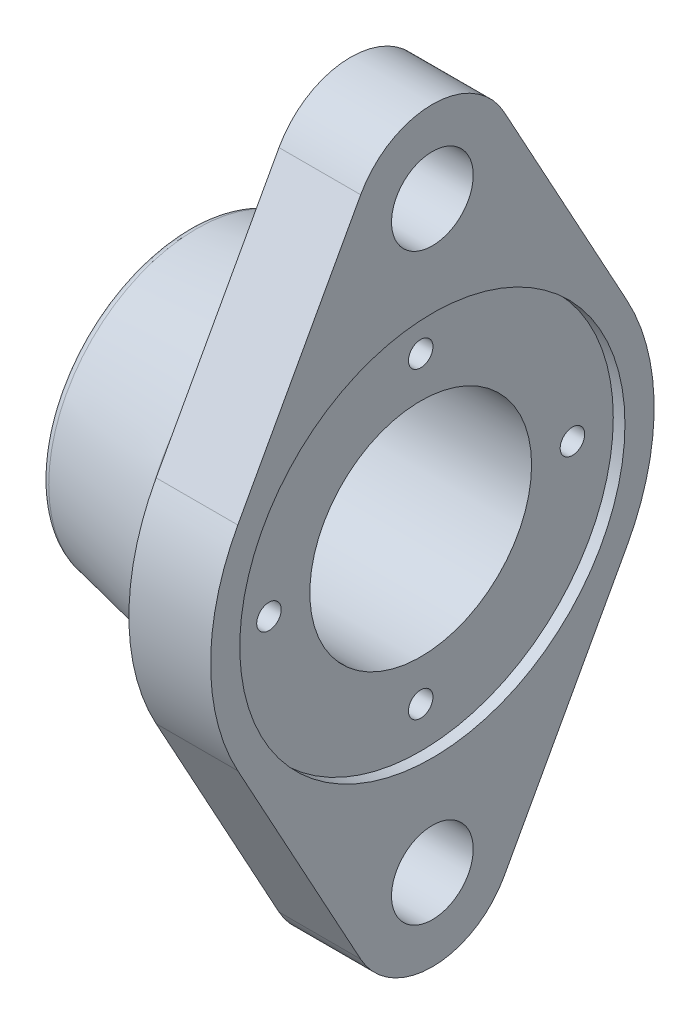
ISO-10303-21;
HEADER;
FILE_DESCRIPTION(('STEP AP214'),'2;1');
FILE_NAME('part.step','',(''),(''),'','','');
FILE_SCHEMA(('AUTOMOTIVE_DESIGN { 1 0 10303 214 1 1 1 1 }'));
ENDSEC;
DATA;
#1=APPLICATION_CONTEXT('core data for automotive mechanical design processes');
#2=APPLICATION_PROTOCOL_DEFINITION('international standard','automotive_design',2000,#1);
#3=PRODUCT_CONTEXT('',#1,'mechanical');
#4=PRODUCT('Part','Part','',(#3));
#5=PRODUCT_RELATED_PRODUCT_CATEGORY('part','',(#4));
#6=PRODUCT_DEFINITION_FORMATION('','',#4);
#7=PRODUCT_DEFINITION_CONTEXT('part definition',#1,'design');
#8=PRODUCT_DEFINITION('design','',#6,#7);
#9=PRODUCT_DEFINITION_SHAPE('','',#8);
#10=(LENGTH_UNIT() NAMED_UNIT(*) SI_UNIT(.MILLI.,.METRE.));
#11=(NAMED_UNIT(*) PLANE_ANGLE_UNIT() SI_UNIT($,.RADIAN.));
#12=(NAMED_UNIT(*) SI_UNIT($,.STERADIAN.) SOLID_ANGLE_UNIT());
#13=UNCERTAINTY_MEASURE_WITH_UNIT(LENGTH_MEASURE(1.E-05),#10,'distance_accuracy_value','');
#14=(GEOMETRIC_REPRESENTATION_CONTEXT(3) GLOBAL_UNCERTAINTY_ASSIGNED_CONTEXT((#13)) GLOBAL_UNIT_ASSIGNED_CONTEXT((#10,
#11,#12)) REPRESENTATION_CONTEXT('',''));
#15=CARTESIAN_POINT('',(0.,0.,0.));
#16=DIRECTION('',(0.,0.,1.));
#17=DIRECTION('',(1.,0.,0.));
#18=AXIS2_PLACEMENT_3D('',#15,#16,#17);
#19=CARTESIAN_POINT('',(-37.4302138620433,0.,0.));
#20=DIRECTION('',(-1.,0.,0.));
#21=DIRECTION('',(0.,0.,1.));
#22=AXIS2_PLACEMENT_3D('',#19,#20,#21);
#23=CYLINDRICAL_SURFACE('',#22,19.);
#24=CARTESIAN_POINT('',(-22.,0.,0.));
#25=DIRECTION('',(1.,0.,0.));
#26=DIRECTION('',(0.,0.,-1.));
#27=AXIS2_PLACEMENT_3D('',#24,#25,#26);
#28=CIRCLE('',#27,19.);
#29=CARTESIAN_POINT('',(-22.,0.,-19.));
#30=VERTEX_POINT('',#29);
#31=EDGE_CURVE('E185',#30,#30,#28,.F.);
#32=ORIENTED_EDGE('',*,*,#31,.T.);
#33=EDGE_LOOP('',(#32));
#34=FACE_BOUND('',#33,.T.);
#35=CARTESIAN_POINT('',(12.,0.,0.));
#36=DIRECTION('',(1.,0.,0.));
#37=DIRECTION('',(0.,0.,-1.));
#38=AXIS2_PLACEMENT_3D('',#35,#36,#37);
#39=CIRCLE('',#38,19.);
#40=CARTESIAN_POINT('',(12.,0.,-19.));
#41=VERTEX_POINT('',#40);
#42=EDGE_CURVE('E492',#41,#41,#39,.T.);
#43=ORIENTED_EDGE('',*,*,#42,.T.);
#44=EDGE_LOOP('',(#43));
#45=FACE_BOUND('',#44,.T.);
#46=ADVANCED_FACE('F38',(#34,#45),#23,.F.);
#47=CARTESIAN_POINT('',(-37.4302138620433,0.,0.));
#48=DIRECTION('',(-1.,0.,0.));
#49=DIRECTION('',(0.,0.,1.));
#50=AXIS2_PLACEMENT_3D('',#47,#48,#49);
#51=CYLINDRICAL_SURFACE('',#50,32.5);
#52=CARTESIAN_POINT('',(-2.,0.,0.));
#53=DIRECTION('',(1.,0.,0.));
#54=DIRECTION('',(0.,0.,-1.));
#55=AXIS2_PLACEMENT_3D('',#52,#53,#54);
#56=CIRCLE('',#55,32.5);
#57=CARTESIAN_POINT('',(-2.,0.,-32.5));
#58=VERTEX_POINT('',#57);
#59=EDGE_CURVE('E191',#58,#58,#56,.F.);
#60=ORIENTED_EDGE('',*,*,#59,.T.);
#61=EDGE_LOOP('',(#60));
#62=FACE_BOUND('',#61,.T.);
#63=CARTESIAN_POINT('',(-4.,0.,0.));
#64=DIRECTION('',(-1.,0.,0.));
#65=DIRECTION('',(0.,0.,1.));
#66=AXIS2_PLACEMENT_3D('',#63,#64,#65);
#67=CIRCLE('',#66,32.5);
#68=CARTESIAN_POINT('',(-4.,0.,32.5));
#69=VERTEX_POINT('',#68);
#70=EDGE_CURVE('E176',#69,#69,#67,.T.);
#71=ORIENTED_EDGE('',*,*,#70,.F.);
#72=EDGE_LOOP('',(#71));
#73=FACE_BOUND('',#72,.T.);
#74=ADVANCED_FACE('F217',(#62,#73),#51,.T.);
#75=CARTESIAN_POINT('',(-4.,32.5,0.));
#76=DIRECTION('',(1.,0.,0.));
#77=DIRECTION('',(0.,0.,-1.));
#78=AXIS2_PLACEMENT_3D('',#75,#76,#77);
#79=PLANE('',#78);
#80=CARTESIAN_POINT('',(-4.,0.,0.));
#81=DIRECTION('',(1.,0.,0.));
#82=DIRECTION('',(0.,0.,-1.));
#83=AXIS2_PLACEMENT_3D('',#80,#81,#82);
#84=CIRCLE('',#83,32.4394126680328);
#85=CARTESIAN_POINT('',(-4.,0.,-32.4394126680328));
#86=VERTEX_POINT('',#85);
#87=EDGE_CURVE('E182',#86,#86,#84,.T.);
#88=ORIENTED_EDGE('',*,*,#87,.T.);
#89=EDGE_LOOP('',(#88));
#90=FACE_BOUND('',#89,.T.);
#91=ORIENTED_EDGE('',*,*,#70,.T.);
#92=EDGE_LOOP('',(#91));
#93=FACE_BOUND('',#92,.T.);
#94=ADVANCED_FACE('F223',(#90,#93),#79,.F.);
#95=CARTESIAN_POINT('',(-4.,0.,0.));
#96=DIRECTION('',(1.,0.,0.));
#97=DIRECTION('',(0.,0.,-1.));
#98=AXIS2_PLACEMENT_3D('',#95,#96,#97);
#99=CONICAL_SURFACE('',#98,30.,0.205395389189767);
#100=CARTESIAN_POINT('',(-26.407908508224,0.,0.));
#101=DIRECTION('',(-1.,0.,0.));
#102=DIRECTION('',(0.,0.,1.));
#103=AXIS2_PLACEMENT_3D('',#100,#101,#102);
#104=CIRCLE('',#103,25.3316857274533);
#105=CARTESIAN_POINT('',(-26.407908508224,0.,25.3316857274533));
#106=VERTEX_POINT('',#105);
#107=EDGE_CURVE('E11',#106,#106,#104,.F.);
#108=ORIENTED_EDGE('',*,*,#107,.T.);
#109=EDGE_LOOP('',(#108));
#110=FACE_BOUND('',#109,.T.);
#111=CARTESIAN_POINT('',(-6.388137237664,0.,0.));
#112=DIRECTION('',(1.,0.,0.));
#113=DIRECTION('',(0.,0.,-1.));
#114=AXIS2_PLACEMENT_3D('',#111,#112,#113);
#115=CIRCLE('',#114,29.50247140882);
#116=CARTESIAN_POINT('',(-6.388137237664,0.,-29.50247140882));
#117=VERTEX_POINT('',#116);
#118=EDGE_CURVE('E179',#117,#117,#115,.F.);
#119=ORIENTED_EDGE('',*,*,#118,.T.);
#120=EDGE_LOOP('',(#119));
#121=FACE_BOUND('',#120,.T.);
#122=ADVANCED_FACE('F259',(#110,#121),#99,.T.);
#123=CARTESIAN_POINT('',(-28.,25.,0.));
#124=DIRECTION('',(1.,0.,0.));
#125=DIRECTION('',(0.,0.,-1.));
#126=AXIS2_PLACEMENT_3D('',#123,#124,#125);
#127=PLANE('',#126);
#128=CARTESIAN_POINT('',(-28.,0.,0.));
#129=DIRECTION('',(1.,0.,0.));
#130=DIRECTION('',(0.,0.,-1.));
#131=AXIS2_PLACEMENT_3D('',#128,#129,#130);
#132=CIRCLE('',#131,23.3737248879781);
#133=CARTESIAN_POINT('',(-28.,0.,-23.3737248879781));
#134=VERTEX_POINT('',#133);
#135=EDGE_CURVE('E47',#134,#134,#132,.F.);
#136=ORIENTED_EDGE('',*,*,#135,.T.);
#137=EDGE_LOOP('',(#136));
#138=FACE_BOUND('',#137,.T.);
#139=CARTESIAN_POINT('',(-28.,0.,0.));
#140=DIRECTION('',(-1.,0.,0.));
#141=DIRECTION('',(0.,0.,1.));
#142=AXIS2_PLACEMENT_3D('',#139,#140,#141);
#143=CIRCLE('',#142,22.5);
#144=CARTESIAN_POINT('',(-28.,0.,22.5));
#145=VERTEX_POINT('',#144);
#146=EDGE_CURVE('E173',#145,#145,#143,.T.);
#147=ORIENTED_EDGE('',*,*,#146,.F.);
#148=EDGE_LOOP('',(#147));
#149=FACE_BOUND('',#148,.T.);
#150=ADVANCED_FACE('F199',(#138,#149),#127,.F.);
#151=CARTESIAN_POINT('',(-37.4302138620433,0.,0.));
#152=DIRECTION('',(-1.,0.,0.));
#153=DIRECTION('',(0.,0.,1.));
#154=AXIS2_PLACEMENT_3D('',#151,#152,#153);
#155=CYLINDRICAL_SURFACE('',#154,22.5);
#156=CARTESIAN_POINT('',(-24.,0.,0.));
#157=DIRECTION('',(-1.,0.,0.));
#158=DIRECTION('',(0.,0.,1.));
#159=AXIS2_PLACEMENT_3D('',#156,#157,#158);
#160=CIRCLE('',#159,22.5);
#161=CARTESIAN_POINT('',(-24.,0.,22.5));
#162=VERTEX_POINT('',#161);
#163=EDGE_CURVE('E170',#162,#162,#160,.T.);
#164=ORIENTED_EDGE('',*,*,#163,.F.);
#165=EDGE_LOOP('',(#164));
#166=FACE_BOUND('',#165,.T.);
#167=ORIENTED_EDGE('',*,*,#146,.T.);
#168=EDGE_LOOP('',(#167));
#169=FACE_BOUND('',#168,.T.);
#170=ADVANCED_FACE('F250',(#166,#169),#155,.F.);
#171=CARTESIAN_POINT('',(-24.,22.5,0.));
#172=DIRECTION('',(1.,0.,0.));
#173=DIRECTION('',(0.,0.,-1.));
#174=AXIS2_PLACEMENT_3D('',#171,#172,#173);
#175=PLANE('',#174);
#176=CARTESIAN_POINT('',(-24.,0.,0.));
#177=DIRECTION('',(1.,0.,0.));
#178=DIRECTION('',(0.,0.,-1.));
#179=AXIS2_PLACEMENT_3D('',#176,#177,#178);
#180=CIRCLE('',#179,21.);
#181=CARTESIAN_POINT('',(-24.,0.,-21.));
#182=VERTEX_POINT('',#181);
#183=EDGE_CURVE('E188',#182,#182,#180,.T.);
#184=ORIENTED_EDGE('',*,*,#183,.T.);
#185=EDGE_LOOP('',(#184));
#186=FACE_BOUND('',#185,.T.);
#187=ORIENTED_EDGE('',*,*,#163,.T.);
#188=EDGE_LOOP('',(#187));
#189=FACE_BOUND('',#188,.T.);
#190=ADVANCED_FACE('F247',(#186,#189),#175,.F.);
#191=CARTESIAN_POINT('',(14.,0.,0.));
#192=DIRECTION('',(1.,0.,0.));
#193=DIRECTION('',(0.,0.,-1.));
#194=AXIS2_PLACEMENT_3D('',#191,#192,#193);
#195=PLANE('',#194);
#196=CARTESIAN_POINT('',(14.,0.,0.));
#197=DIRECTION('',(1.,0.,0.));
#198=DIRECTION('',(0.,0.,-1.));
#199=AXIS2_PLACEMENT_3D('',#196,#197,#198);
#200=CIRCLE('',#199,33.);
#201=CARTESIAN_POINT('',(14.,0.,-33.));
#202=VERTEX_POINT('',#201);
#203=EDGE_CURVE('E489',#202,#202,#200,.T.);
#204=ORIENTED_EDGE('',*,*,#203,.F.);
#205=EDGE_LOOP('',(#204));
#206=FACE_BOUND('',#205,.T.);
#207=CARTESIAN_POINT('',(14.,-50.,0.));
#208=DIRECTION('',(1.,0.,0.));
#209=DIRECTION('',(0.,0.,-1.));
#210=AXIS2_PLACEMENT_3D('',#207,#208,#209);
#211=CIRCLE('',#210,7.);
#212=CARTESIAN_POINT('',(14.,-50.,-7.00000000000002));
#213=VERTEX_POINT('',#212);
#214=EDGE_CURVE('E144',#213,#213,#211,.T.);
#215=ORIENTED_EDGE('',*,*,#214,.F.);
#216=EDGE_LOOP('',(#215));
#217=FACE_BOUND('',#216,.T.);
#218=CARTESIAN_POINT('',(14.,0.,0.));
#219=DIRECTION('',(1.,0.,0.));
#220=DIRECTION('',(0.,0.,-1.));
#221=AXIS2_PLACEMENT_3D('',#218,#219,#220);
#222=CIRCLE('',#221,38.);
#223=CARTESIAN_POINT('',(14.,18.24,33.3362025431812));
#224=VERTEX_POINT('',#223);
#225=CARTESIAN_POINT('',(14.,-18.24,33.3362025431812));
#226=VERTEX_POINT('',#225);
#227=EDGE_CURVE('E155',#224,#226,#222,.T.);
#228=ORIENTED_EDGE('',*,*,#227,.T.);
#229=DIRECTION('',(0.,-0.877268487978452,-0.48));
#230=VECTOR('',#229,1.);
#231=CARTESIAN_POINT('',(14.,-18.24,33.3362025431812));
#232=LINE('',#231,#230);
#233=CARTESIAN_POINT('',(14.,-56.72,12.2817588316983));
#234=VERTEX_POINT('',#233);
#235=EDGE_CURVE('E100',#226,#234,#232,.T.);
#236=ORIENTED_EDGE('',*,*,#235,.T.);
#237=CARTESIAN_POINT('',(14.,-50.,0.));
#238=DIRECTION('',(1.,0.,0.));
#239=DIRECTION('',(0.,0.,-1.));
#240=AXIS2_PLACEMENT_3D('',#237,#238,#239);
#241=CIRCLE('',#240,14.);
#242=CARTESIAN_POINT('',(14.,-56.72,-12.2817588316984));
#243=VERTEX_POINT('',#242);
#244=EDGE_CURVE('E469',#234,#243,#241,.T.);
#245=ORIENTED_EDGE('',*,*,#244,.T.);
#246=DIRECTION('',(0.,0.877268487978452,-0.48));
#247=VECTOR('',#246,1.);
#248=CARTESIAN_POINT('',(14.,-56.72,-12.2817588316984));
#249=LINE('',#248,#247);
#250=CARTESIAN_POINT('',(14.,-18.24,-33.3362025431812));
#251=VERTEX_POINT('',#250);
#252=EDGE_CURVE('E471',#243,#251,#249,.T.);
#253=ORIENTED_EDGE('',*,*,#252,.T.);
#254=CARTESIAN_POINT('',(14.,0.,0.));
#255=DIRECTION('',(1.,0.,0.));
#256=DIRECTION('',(0.,0.,-1.));
#257=AXIS2_PLACEMENT_3D('',#254,#255,#256);
#258=CIRCLE('',#257,38.);
#259=CARTESIAN_POINT('',(14.,18.24,-33.3362025431812));
#260=VERTEX_POINT('',#259);
#261=EDGE_CURVE('E122',#251,#260,#258,.T.);
#262=ORIENTED_EDGE('',*,*,#261,.T.);
#263=DIRECTION('',(0.,0.877268487978452,0.48));
#264=VECTOR('',#263,1.);
#265=CARTESIAN_POINT('',(14.,18.24,-33.3362025431812));
#266=LINE('',#265,#264);
#267=CARTESIAN_POINT('',(14.,56.72,-12.2817588316983));
#268=VERTEX_POINT('',#267);
#269=EDGE_CURVE('E115',#260,#268,#266,.T.);
#270=ORIENTED_EDGE('',*,*,#269,.T.);
#271=CARTESIAN_POINT('',(14.,50.,0.));
#272=DIRECTION('',(1.,0.,0.));
#273=DIRECTION('',(0.,0.,-1.));
#274=AXIS2_PLACEMENT_3D('',#271,#272,#273);
#275=CIRCLE('',#274,14.);
#276=CARTESIAN_POINT('',(14.,56.72,12.2817588316983));
#277=VERTEX_POINT('',#276);
#278=EDGE_CURVE('E120',#268,#277,#275,.T.);
#279=ORIENTED_EDGE('',*,*,#278,.T.);
#280=DIRECTION('',(0.,-0.877268487978452,0.48));
#281=VECTOR('',#280,1.);
#282=CARTESIAN_POINT('',(14.,56.72,12.2817588316983));
#283=LINE('',#282,#281);
#284=EDGE_CURVE('E55',#277,#224,#283,.T.);
#285=ORIENTED_EDGE('',*,*,#284,.T.);
#286=EDGE_LOOP('',(#228,#236,#245,#253,#262,#270,#279,#285));
#287=FACE_BOUND('',#286,.T.);
#288=CARTESIAN_POINT('',(14.,50.,0.));
#289=DIRECTION('',(1.,0.,0.));
#290=DIRECTION('',(0.,0.,-1.));
#291=AXIS2_PLACEMENT_3D('',#288,#289,#290);
#292=CIRCLE('',#291,7.);
#293=CARTESIAN_POINT('',(14.,50.,-7.00000000000001));
#294=VERTEX_POINT('',#293);
#295=EDGE_CURVE('E480',#294,#294,#292,.T.);
#296=ORIENTED_EDGE('',*,*,#295,.F.);
#297=EDGE_LOOP('',(#296));
#298=FACE_BOUND('',#297,.T.);
#299=ADVANCED_FACE('F117',(#206,#217,#287,#298),#195,.T.);
#300=CARTESIAN_POINT('',(0.,0.,0.));
#301=DIRECTION('',(1.,0.,0.));
#302=DIRECTION('',(0.,0.,-1.));
#303=AXIS2_PLACEMENT_3D('',#300,#301,#302);
#304=PLANE('',#303);
#305=CARTESIAN_POINT('',(0.,0.,0.));
#306=DIRECTION('',(1.,0.,0.));
#307=DIRECTION('',(0.,0.,-1.));
#308=AXIS2_PLACEMENT_3D('',#305,#306,#307);
#309=CIRCLE('',#308,34.5);
#310=CARTESIAN_POINT('',(0.,0.,-34.5));
#311=VERTEX_POINT('',#310);
#312=EDGE_CURVE('E194',#311,#311,#309,.T.);
#313=ORIENTED_EDGE('',*,*,#312,.T.);
#314=EDGE_LOOP('',(#313));
#315=FACE_BOUND('',#314,.T.);
#316=CARTESIAN_POINT('',(0.,0.,0.));
#317=DIRECTION('',(1.,0.,0.));
#318=DIRECTION('',(0.,0.,-1.));
#319=AXIS2_PLACEMENT_3D('',#316,#317,#318);
#320=CIRCLE('',#319,38.);
#321=CARTESIAN_POINT('',(0.,18.24,33.3362025431812));
#322=VERTEX_POINT('',#321);
#323=CARTESIAN_POINT('',(0.,-18.24,33.3362025431812));
#324=VERTEX_POINT('',#323);
#325=EDGE_CURVE('E140',#322,#324,#320,.T.);
#326=ORIENTED_EDGE('',*,*,#325,.F.);
#327=DIRECTION('',(0.,-0.877268487978452,0.48));
#328=VECTOR('',#327,1.);
#329=CARTESIAN_POINT('',(0.,56.72,12.2817588316983));
#330=LINE('',#329,#328);
#331=CARTESIAN_POINT('',(0.,56.72,12.2817588316983));
#332=VERTEX_POINT('',#331);
#333=EDGE_CURVE('E91',#332,#322,#330,.T.);
#334=ORIENTED_EDGE('',*,*,#333,.F.);
#335=CARTESIAN_POINT('',(0.,50.,0.));
#336=DIRECTION('',(1.,0.,0.));
#337=DIRECTION('',(0.,0.,-1.));
#338=AXIS2_PLACEMENT_3D('',#335,#336,#337);
#339=CIRCLE('',#338,14.);
#340=CARTESIAN_POINT('',(0.,56.72,-12.2817588316983));
#341=VERTEX_POINT('',#340);
#342=EDGE_CURVE('E85',#341,#332,#339,.T.);
#343=ORIENTED_EDGE('',*,*,#342,.F.);
#344=DIRECTION('',(0.,0.877268487978452,0.48));
#345=VECTOR('',#344,1.);
#346=CARTESIAN_POINT('',(0.,18.24,-33.3362025431812));
#347=LINE('',#346,#345);
#348=CARTESIAN_POINT('',(0.,18.24,-33.3362025431812));
#349=VERTEX_POINT('',#348);
#350=EDGE_CURVE('E130',#349,#341,#347,.T.);
#351=ORIENTED_EDGE('',*,*,#350,.F.);
#352=CARTESIAN_POINT('',(0.,0.,0.));
#353=DIRECTION('',(1.,0.,0.));
#354=DIRECTION('',(0.,0.,-1.));
#355=AXIS2_PLACEMENT_3D('',#352,#353,#354);
#356=CIRCLE('',#355,38.);
#357=CARTESIAN_POINT('',(0.,-18.24,-33.3362025431812));
#358=VERTEX_POINT('',#357);
#359=EDGE_CURVE('E150',#358,#349,#356,.T.);
#360=ORIENTED_EDGE('',*,*,#359,.F.);
#361=DIRECTION('',(0.,0.877268487978452,-0.48));
#362=VECTOR('',#361,1.);
#363=CARTESIAN_POINT('',(0.,-56.72,-12.2817588316984));
#364=LINE('',#363,#362);
#365=CARTESIAN_POINT('',(0.,-56.72,-12.2817588316984));
#366=VERTEX_POINT('',#365);
#367=EDGE_CURVE('E148',#366,#358,#364,.T.);
#368=ORIENTED_EDGE('',*,*,#367,.F.);
#369=CARTESIAN_POINT('',(0.,-50.,0.));
#370=DIRECTION('',(1.,0.,0.));
#371=DIRECTION('',(0.,0.,-1.));
#372=AXIS2_PLACEMENT_3D('',#369,#370,#371);
#373=CIRCLE('',#372,14.);
#374=CARTESIAN_POINT('',(0.,-56.72,12.2817588316983));
#375=VERTEX_POINT('',#374);
#376=EDGE_CURVE('E146',#375,#366,#373,.T.);
#377=ORIENTED_EDGE('',*,*,#376,.F.);
#378=DIRECTION('',(0.,-0.877268487978452,-0.48));
#379=VECTOR('',#378,1.);
#380=CARTESIAN_POINT('',(0.,-18.24,33.3362025431812));
#381=LINE('',#380,#379);
#382=EDGE_CURVE('E143',#324,#375,#381,.T.);
#383=ORIENTED_EDGE('',*,*,#382,.F.);
#384=EDGE_LOOP('',(#326,#334,#343,#351,#360,#368,#377,#383));
#385=FACE_BOUND('',#384,.T.);
#386=CARTESIAN_POINT('',(0.,-50.,0.));
#387=DIRECTION('',(1.,0.,0.));
#388=DIRECTION('',(0.,0.,-1.));
#389=AXIS2_PLACEMENT_3D('',#386,#387,#388);
#390=CIRCLE('',#389,7.);
#391=CARTESIAN_POINT('',(0.,-50.,-7.00000000000002));
#392=VERTEX_POINT('',#391);
#393=EDGE_CURVE('E477',#392,#392,#390,.T.);
#394=ORIENTED_EDGE('',*,*,#393,.T.);
#395=EDGE_LOOP('',(#394));
#396=FACE_BOUND('',#395,.T.);
#397=CARTESIAN_POINT('',(0.,50.,0.));
#398=DIRECTION('',(1.,0.,0.));
#399=DIRECTION('',(0.,0.,-1.));
#400=AXIS2_PLACEMENT_3D('',#397,#398,#399);
#401=CIRCLE('',#400,7.);
#402=CARTESIAN_POINT('',(0.,50.,-7.00000000000001));
#403=VERTEX_POINT('',#402);
#404=EDGE_CURVE('E483',#403,#403,#401,.T.);
#405=ORIENTED_EDGE('',*,*,#404,.T.);
#406=EDGE_LOOP('',(#405));
#407=FACE_BOUND('',#406,.T.);
#408=ADVANCED_FACE('F297',(#315,#385,#396,#407),#304,.F.);
#409=CARTESIAN_POINT('',(14.,0.,0.));
#410=DIRECTION('',(-1.,0.,0.));
#411=DIRECTION('',(0.,0.,1.));
#412=AXIS2_PLACEMENT_3D('',#409,#410,#411);
#413=CYLINDRICAL_SURFACE('',#412,38.);
#414=ORIENTED_EDGE('',*,*,#325,.T.);
#415=DIRECTION('',(-1.,0.,0.));
#416=VECTOR('',#415,1.);
#417=CARTESIAN_POINT('',(14.,-18.24,33.3362025431812));
#418=LINE('',#417,#416);
#419=EDGE_CURVE('E168',#226,#324,#418,.T.);
#420=ORIENTED_EDGE('',*,*,#419,.F.);
#421=ORIENTED_EDGE('',*,*,#227,.F.);
#422=DIRECTION('',(-1.,0.,0.));
#423=VECTOR('',#422,1.);
#424=CARTESIAN_POINT('',(14.,18.24,33.3362025431812));
#425=LINE('',#424,#423);
#426=EDGE_CURVE('E136',#224,#322,#425,.T.);
#427=ORIENTED_EDGE('',*,*,#426,.T.);
#428=EDGE_LOOP('',(#414,#420,#421,#427));
#429=FACE_BOUND('',#428,.T.);
#430=ADVANCED_FACE('F302',(#429),#413,.T.);
#431=CARTESIAN_POINT('',(14.,-18.24,33.3362025431812));
#432=DIRECTION('',(0.,0.48,-0.877268487978452));
#433=DIRECTION('',(0.,0.877268487978452,0.48));
#434=AXIS2_PLACEMENT_3D('',#431,#432,#433);
#435=PLANE('',#434);
#436=ORIENTED_EDGE('',*,*,#382,.T.);
#437=DIRECTION('',(-1.,0.,0.));
#438=VECTOR('',#437,1.);
#439=CARTESIAN_POINT('',(14.,-56.72,12.2817588316983));
#440=LINE('',#439,#438);
#441=EDGE_CURVE('E165',#234,#375,#440,.T.);
#442=ORIENTED_EDGE('',*,*,#441,.F.);
#443=ORIENTED_EDGE('',*,*,#235,.F.);
#444=ORIENTED_EDGE('',*,*,#419,.T.);
#445=EDGE_LOOP('',(#436,#442,#443,#444));
#446=FACE_BOUND('',#445,.T.);
#447=ADVANCED_FACE('F453',(#446),#435,.F.);
#448=CARTESIAN_POINT('',(14.,-50.,0.));
#449=DIRECTION('',(-1.,0.,0.));
#450=DIRECTION('',(0.,0.,1.));
#451=AXIS2_PLACEMENT_3D('',#448,#449,#450);
#452=CYLINDRICAL_SURFACE('',#451,14.);
#453=ORIENTED_EDGE('',*,*,#376,.T.);
#454=DIRECTION('',(-1.,0.,0.));
#455=VECTOR('',#454,1.);
#456=CARTESIAN_POINT('',(14.,-56.72,-12.2817588316984));
#457=LINE('',#456,#455);
#458=EDGE_CURVE('E162',#243,#366,#457,.T.);
#459=ORIENTED_EDGE('',*,*,#458,.F.);
#460=ORIENTED_EDGE('',*,*,#244,.F.);
#461=ORIENTED_EDGE('',*,*,#441,.T.);
#462=EDGE_LOOP('',(#453,#459,#460,#461));
#463=FACE_BOUND('',#462,.T.);
#464=ADVANCED_FACE('F449',(#463),#452,.T.);
#465=CARTESIAN_POINT('',(14.,-56.72,-12.2817588316984));
#466=DIRECTION('',(0.,0.48,0.877268487978452));
#467=DIRECTION('',(0.,-0.877268487978453,0.48));
#468=AXIS2_PLACEMENT_3D('',#465,#466,#467);
#469=PLANE('',#468);
#470=ORIENTED_EDGE('',*,*,#367,.T.);
#471=DIRECTION('',(-1.,0.,0.));
#472=VECTOR('',#471,1.);
#473=CARTESIAN_POINT('',(14.,-18.24,-33.3362025431812));
#474=LINE('',#473,#472);
#475=EDGE_CURVE('E159',#251,#358,#474,.T.);
#476=ORIENTED_EDGE('',*,*,#475,.F.);
#477=ORIENTED_EDGE('',*,*,#252,.F.);
#478=ORIENTED_EDGE('',*,*,#458,.T.);
#479=EDGE_LOOP('',(#470,#476,#477,#478));
#480=FACE_BOUND('',#479,.T.);
#481=ADVANCED_FACE('F445',(#480),#469,.F.);
#482=CARTESIAN_POINT('',(14.,0.,0.));
#483=DIRECTION('',(-1.,0.,0.));
#484=DIRECTION('',(0.,0.,1.));
#485=AXIS2_PLACEMENT_3D('',#482,#483,#484);
#486=CYLINDRICAL_SURFACE('',#485,38.);
#487=ORIENTED_EDGE('',*,*,#359,.T.);
#488=DIRECTION('',(-1.,0.,0.));
#489=VECTOR('',#488,1.);
#490=CARTESIAN_POINT('',(14.,18.24,-33.3362025431812));
#491=LINE('',#490,#489);
#492=EDGE_CURVE('E131',#260,#349,#491,.T.);
#493=ORIENTED_EDGE('',*,*,#492,.F.);
#494=ORIENTED_EDGE('',*,*,#261,.F.);
#495=ORIENTED_EDGE('',*,*,#475,.T.);
#496=EDGE_LOOP('',(#487,#493,#494,#495));
#497=FACE_BOUND('',#496,.T.);
#498=ADVANCED_FACE('F442',(#497),#486,.T.);
#499=CARTESIAN_POINT('',(14.,18.24,-33.3362025431812));
#500=DIRECTION('',(0.,-0.48,0.877268487978452));
#501=DIRECTION('',(0.,-0.877268487978453,-0.48));
#502=AXIS2_PLACEMENT_3D('',#499,#500,#501);
#503=PLANE('',#502);
#504=ORIENTED_EDGE('',*,*,#350,.T.);
#505=DIRECTION('',(-1.,0.,0.));
#506=VECTOR('',#505,1.);
#507=CARTESIAN_POINT('',(14.,56.72,-12.2817588316983));
#508=LINE('',#507,#506);
#509=EDGE_CURVE('E127',#268,#341,#508,.T.);
#510=ORIENTED_EDGE('',*,*,#509,.F.);
#511=ORIENTED_EDGE('',*,*,#269,.F.);
#512=ORIENTED_EDGE('',*,*,#492,.T.);
#513=EDGE_LOOP('',(#504,#510,#511,#512));
#514=FACE_BOUND('',#513,.T.);
#515=ADVANCED_FACE('F128',(#514),#503,.F.);
#516=CARTESIAN_POINT('',(14.,50.,0.));
#517=DIRECTION('',(-1.,0.,0.));
#518=DIRECTION('',(0.,0.,1.));
#519=AXIS2_PLACEMENT_3D('',#516,#517,#518);
#520=CYLINDRICAL_SURFACE('',#519,14.);
#521=ORIENTED_EDGE('',*,*,#342,.T.);
#522=DIRECTION('',(-1.,0.,0.));
#523=VECTOR('',#522,1.);
#524=CARTESIAN_POINT('',(14.,56.72,12.2817588316983));
#525=LINE('',#524,#523);
#526=EDGE_CURVE('E132',#277,#332,#525,.T.);
#527=ORIENTED_EDGE('',*,*,#526,.F.);
#528=ORIENTED_EDGE('',*,*,#278,.F.);
#529=ORIENTED_EDGE('',*,*,#509,.T.);
#530=EDGE_LOOP('',(#521,#527,#528,#529));
#531=FACE_BOUND('',#530,.T.);
#532=ADVANCED_FACE('F134',(#531),#520,.T.);
#533=CARTESIAN_POINT('',(14.,56.72,12.2817588316983));
#534=DIRECTION('',(0.,-0.48,-0.877268487978452));
#535=DIRECTION('',(0.,0.877268487978452,-0.48));
#536=AXIS2_PLACEMENT_3D('',#533,#534,#535);
#537=PLANE('',#536);
#538=ORIENTED_EDGE('',*,*,#333,.T.);
#539=ORIENTED_EDGE('',*,*,#426,.F.);
#540=ORIENTED_EDGE('',*,*,#284,.F.);
#541=ORIENTED_EDGE('',*,*,#526,.T.);
#542=EDGE_LOOP('',(#538,#539,#540,#541));
#543=FACE_BOUND('',#542,.T.);
#544=ADVANCED_FACE('F432',(#543),#537,.F.);
#545=CARTESIAN_POINT('',(14.,-50.,0.));
#546=DIRECTION('',(-1.,0.,0.));
#547=DIRECTION('',(0.,0.,1.));
#548=AXIS2_PLACEMENT_3D('',#545,#546,#547);
#549=CYLINDRICAL_SURFACE('',#548,7.);
#550=ORIENTED_EDGE('',*,*,#214,.T.);
#551=EDGE_LOOP('',(#550));
#552=FACE_BOUND('',#551,.T.);
#553=ORIENTED_EDGE('',*,*,#393,.F.);
#554=EDGE_LOOP('',(#553));
#555=FACE_BOUND('',#554,.T.);
#556=ADVANCED_FACE('F428',(#552,#555),#549,.F.);
#557=CARTESIAN_POINT('',(14.,50.,0.));
#558=DIRECTION('',(-1.,0.,0.));
#559=DIRECTION('',(0.,0.,1.));
#560=AXIS2_PLACEMENT_3D('',#557,#558,#559);
#561=CYLINDRICAL_SURFACE('',#560,7.);
#562=ORIENTED_EDGE('',*,*,#295,.T.);
#563=EDGE_LOOP('',(#562));
#564=FACE_BOUND('',#563,.T.);
#565=ORIENTED_EDGE('',*,*,#404,.F.);
#566=EDGE_LOOP('',(#565));
#567=FACE_BOUND('',#566,.T.);
#568=ADVANCED_FACE('F233',(#564,#567),#561,.F.);
#569=CARTESIAN_POINT('',(-7.,0.,0.));
#570=DIRECTION('',(1.,0.,0.));
#571=DIRECTION('',(0.,0.,-1.));
#572=AXIS2_PLACEMENT_3D('',#569,#570,#571);
#573=TOROIDAL_SURFACE('',#572,32.4394126680328,3.);
#574=ORIENTED_EDGE('',*,*,#87,.F.);
#575=EDGE_LOOP('',(#574));
#576=FACE_BOUND('',#575,.T.);
#577=ORIENTED_EDGE('',*,*,#118,.F.);
#578=EDGE_LOOP('',(#577));
#579=FACE_BOUND('',#578,.T.);
#580=ADVANCED_FACE('F229',(#576,#579),#573,.F.);
#581=CARTESIAN_POINT('',(12.,0.,0.));
#582=DIRECTION('',(1.,0.,0.));
#583=DIRECTION('',(0.,0.,-1.));
#584=AXIS2_PLACEMENT_3D('',#581,#582,#583);
#585=CYLINDRICAL_SURFACE('',#584,33.);
#586=CARTESIAN_POINT('',(12.,0.,0.));
#587=DIRECTION('',(1.,0.,0.));
#588=DIRECTION('',(0.,0.,-1.));
#589=AXIS2_PLACEMENT_3D('',#586,#587,#588);
#590=CIRCLE('',#589,33.);
#591=CARTESIAN_POINT('',(12.,0.,-33.));
#592=VERTEX_POINT('',#591);
#593=EDGE_CURVE('E486',#592,#592,#590,.T.);
#594=ORIENTED_EDGE('',*,*,#593,.F.);
#595=EDGE_LOOP('',(#594));
#596=FACE_BOUND('',#595,.T.);
#597=ORIENTED_EDGE('',*,*,#203,.T.);
#598=EDGE_LOOP('',(#597));
#599=FACE_BOUND('',#598,.T.);
#600=ADVANCED_FACE('F232',(#596,#599),#585,.F.);
#601=CARTESIAN_POINT('',(12.,0.,0.));
#602=DIRECTION('',(1.,0.,0.));
#603=DIRECTION('',(0.,0.,-1.));
#604=AXIS2_PLACEMENT_3D('',#601,#602,#603);
#605=PLANE('',#604);
#606=CARTESIAN_POINT('',(12.,26.,2.72335544429764E-13));
#607=DIRECTION('',(1.,0.,0.));
#608=DIRECTION('',(0.,0.,-1.));
#609=AXIS2_PLACEMENT_3D('',#606,#607,#608);
#610=CIRCLE('',#609,2.09999999999999);
#611=CARTESIAN_POINT('',(12.,26.,-2.09999999999971));
#612=VERTEX_POINT('',#611);
#613=EDGE_CURVE('E518',#612,#612,#610,.T.);
#614=ORIENTED_EDGE('',*,*,#613,.F.);
#615=EDGE_LOOP('',(#614));
#616=FACE_BOUND('',#615,.T.);
#617=CARTESIAN_POINT('',(12.,0.,-26.));
#618=DIRECTION('',(1.,0.,0.));
#619=DIRECTION('',(0.,0.,-1.));
#620=AXIS2_PLACEMENT_3D('',#617,#618,#619);
#621=CIRCLE('',#620,2.09999999999999);
#622=CARTESIAN_POINT('',(12.,0.,-28.1));
#623=VERTEX_POINT('',#622);
#624=EDGE_CURVE('E512',#623,#623,#621,.T.);
#625=ORIENTED_EDGE('',*,*,#624,.F.);
#626=EDGE_LOOP('',(#625));
#627=FACE_BOUND('',#626,.T.);
#628=CARTESIAN_POINT('',(12.,-26.,0.));
#629=DIRECTION('',(1.,0.,0.));
#630=DIRECTION('',(0.,0.,-1.));
#631=AXIS2_PLACEMENT_3D('',#628,#629,#630);
#632=CIRCLE('',#631,2.09999999999999);
#633=CARTESIAN_POINT('',(12.,-26.,-2.10000000000008));
#634=VERTEX_POINT('',#633);
#635=EDGE_CURVE('E506',#634,#634,#632,.T.);
#636=ORIENTED_EDGE('',*,*,#635,.F.);
#637=EDGE_LOOP('',(#636));
#638=FACE_BOUND('',#637,.T.);
#639=CARTESIAN_POINT('',(12.,0.,26.));
#640=DIRECTION('',(1.,0.,0.));
#641=DIRECTION('',(0.,0.,-1.));
#642=AXIS2_PLACEMENT_3D('',#639,#640,#641);
#643=CIRCLE('',#642,2.09999999999999);
#644=CARTESIAN_POINT('',(12.,0.,23.9));
#645=VERTEX_POINT('',#644);
#646=EDGE_CURVE('E500',#645,#645,#643,.T.);
#647=ORIENTED_EDGE('',*,*,#646,.F.);
#648=EDGE_LOOP('',(#647));
#649=FACE_BOUND('',#648,.T.);
#650=ORIENTED_EDGE('',*,*,#42,.F.);
#651=EDGE_LOOP('',(#650));
#652=FACE_BOUND('',#651,.T.);
#653=ORIENTED_EDGE('',*,*,#593,.T.);
#654=EDGE_LOOP('',(#653));
#655=FACE_BOUND('',#654,.T.);
#656=ADVANCED_FACE('F236',(#616,#627,#638,#649,#652,#655),#605,.T.);
#657=CARTESIAN_POINT('',(-22.,0.,0.));
#658=DIRECTION('',(-1.,0.,0.));
#659=DIRECTION('',(0.,0.,1.));
#660=AXIS2_PLACEMENT_3D('',#657,#658,#659);
#661=CONICAL_SURFACE('',#660,19.,0.785398163397449);
#662=ORIENTED_EDGE('',*,*,#183,.F.);
#663=EDGE_LOOP('',(#662));
#664=FACE_BOUND('',#663,.T.);
#665=ORIENTED_EDGE('',*,*,#31,.F.);
#666=EDGE_LOOP('',(#665));
#667=FACE_BOUND('',#666,.T.);
#668=ADVANCED_FACE('F213',(#664,#667),#661,.F.);
#669=CARTESIAN_POINT('',(-2.,0.,0.));
#670=DIRECTION('',(1.,0.,0.));
#671=DIRECTION('',(0.,0.,-1.));
#672=AXIS2_PLACEMENT_3D('',#669,#670,#671);
#673=TOROIDAL_SURFACE('',#672,34.5,2.);
#674=ORIENTED_EDGE('',*,*,#312,.F.);
#675=EDGE_LOOP('',(#674));
#676=FACE_BOUND('',#675,.T.);
#677=ORIENTED_EDGE('',*,*,#59,.F.);
#678=EDGE_LOOP('',(#677));
#679=FACE_BOUND('',#678,.T.);
#680=ADVANCED_FACE('F204',(#676,#679),#673,.F.);
#681=CARTESIAN_POINT('',(-26.,0.,0.));
#682=DIRECTION('',(1.,0.,0.));
#683=DIRECTION('',(0.,0.,-1.));
#684=AXIS2_PLACEMENT_3D('',#681,#682,#683);
#685=TOROIDAL_SURFACE('',#684,23.3737248879781,2.);
#686=ORIENTED_EDGE('',*,*,#107,.F.);
#687=EDGE_LOOP('',(#686));
#688=FACE_BOUND('',#687,.T.);
#689=ORIENTED_EDGE('',*,*,#135,.F.);
#690=EDGE_LOOP('',(#689));
#691=FACE_BOUND('',#690,.T.);
#692=ADVANCED_FACE('F40',(#688,#691),#685,.T.);
#693=CARTESIAN_POINT('',(2.,0.,26.));
#694=DIRECTION('',(1.,0.,0.));
#695=DIRECTION('',(0.,0.,-1.));
#696=AXIS2_PLACEMENT_3D('',#693,#694,#695);
#697=CONICAL_SURFACE('',#696,2.1,1.02974425867665);
#698=CARTESIAN_POINT('',(0.738192700042125,0.,26.));
#699=VERTEX_POINT('',#698);
#700=VERTEX_LOOP('',#699);
#701=FACE_BOUND('',#700,.T.);
#702=CARTESIAN_POINT('',(2.,0.,26.));
#703=DIRECTION('',(1.,0.,0.));
#704=DIRECTION('',(0.,0.,-1.));
#705=AXIS2_PLACEMENT_3D('',#702,#703,#704);
#706=CIRCLE('',#705,2.1);
#707=CARTESIAN_POINT('',(2.,0.,23.9));
#708=VERTEX_POINT('',#707);
#709=EDGE_CURVE('E497',#708,#708,#706,.T.);
#710=ORIENTED_EDGE('',*,*,#709,.T.);
#711=EDGE_LOOP('',(#710));
#712=FACE_BOUND('',#711,.T.);
#713=ADVANCED_FACE('F203',(#701,#712),#697,.F.);
#714=CARTESIAN_POINT('',(12.,0.,26.));
#715=DIRECTION('',(1.,0.,0.));
#716=DIRECTION('',(0.,0.,-1.));
#717=AXIS2_PLACEMENT_3D('',#714,#715,#716);
#718=CYLINDRICAL_SURFACE('',#717,2.09999999999999);
#719=ORIENTED_EDGE('',*,*,#709,.F.);
#720=EDGE_LOOP('',(#719));
#721=FACE_BOUND('',#720,.T.);
#722=ORIENTED_EDGE('',*,*,#646,.T.);
#723=EDGE_LOOP('',(#722));
#724=FACE_BOUND('',#723,.T.);
#725=ADVANCED_FACE('F210',(#721,#724),#718,.F.);
#726=CARTESIAN_POINT('',(2.,-26.,0.));
#727=DIRECTION('',(1.,0.,0.));
#728=DIRECTION('',(0.,0.,-1.));
#729=AXIS2_PLACEMENT_3D('',#726,#727,#728);
#730=CONICAL_SURFACE('',#729,2.1,1.02974425867665);
#731=CARTESIAN_POINT('',(0.738192700042125,-26.,0.));
#732=VERTEX_POINT('',#731);
#733=VERTEX_LOOP('',#732);
#734=FACE_BOUND('',#733,.T.);
#735=CARTESIAN_POINT('',(2.,-26.,0.));
#736=DIRECTION('',(1.,0.,0.));
#737=DIRECTION('',(0.,0.,-1.));
#738=AXIS2_PLACEMENT_3D('',#735,#736,#737);
#739=CIRCLE('',#738,2.1);
#740=CARTESIAN_POINT('',(2.,-26.,-2.10000000000009));
#741=VERTEX_POINT('',#740);
#742=EDGE_CURVE('E503',#741,#741,#739,.T.);
#743=ORIENTED_EDGE('',*,*,#742,.T.);
#744=EDGE_LOOP('',(#743));
#745=FACE_BOUND('',#744,.T.);
#746=ADVANCED_FACE('F334',(#734,#745),#730,.F.);
#747=CARTESIAN_POINT('',(12.,-26.,0.));
#748=DIRECTION('',(1.,0.,0.));
#749=DIRECTION('',(0.,0.,-1.));
#750=AXIS2_PLACEMENT_3D('',#747,#748,#749);
#751=CYLINDRICAL_SURFACE('',#750,2.09999999999999);
#752=ORIENTED_EDGE('',*,*,#742,.F.);
#753=EDGE_LOOP('',(#752));
#754=FACE_BOUND('',#753,.T.);
#755=ORIENTED_EDGE('',*,*,#635,.T.);
#756=EDGE_LOOP('',(#755));
#757=FACE_BOUND('',#756,.T.);
#758=ADVANCED_FACE('F354',(#754,#757),#751,.F.);
#759=CARTESIAN_POINT('',(2.,0.,-26.));
#760=DIRECTION('',(1.,0.,0.));
#761=DIRECTION('',(0.,0.,-1.));
#762=AXIS2_PLACEMENT_3D('',#759,#760,#761);
#763=CONICAL_SURFACE('',#762,2.1,1.02974425867665);
#764=CARTESIAN_POINT('',(0.738192700042125,0.,-26.));
#765=VERTEX_POINT('',#764);
#766=VERTEX_LOOP('',#765);
#767=FACE_BOUND('',#766,.T.);
#768=CARTESIAN_POINT('',(2.,0.,-26.));
#769=DIRECTION('',(1.,0.,0.));
#770=DIRECTION('',(0.,0.,-1.));
#771=AXIS2_PLACEMENT_3D('',#768,#769,#770);
#772=CIRCLE('',#771,2.1);
#773=CARTESIAN_POINT('',(2.,0.,-28.1));
#774=VERTEX_POINT('',#773);
#775=EDGE_CURVE('E509',#774,#774,#772,.T.);
#776=ORIENTED_EDGE('',*,*,#775,.T.);
#777=EDGE_LOOP('',(#776));
#778=FACE_BOUND('',#777,.T.);
#779=ADVANCED_FACE('F365',(#767,#778),#763,.F.);
#780=CARTESIAN_POINT('',(12.,0.,-26.));
#781=DIRECTION('',(1.,0.,0.));
#782=DIRECTION('',(0.,0.,-1.));
#783=AXIS2_PLACEMENT_3D('',#780,#781,#782);
#784=CYLINDRICAL_SURFACE('',#783,2.09999999999999);
#785=ORIENTED_EDGE('',*,*,#775,.F.);
#786=EDGE_LOOP('',(#785));
#787=FACE_BOUND('',#786,.T.);
#788=ORIENTED_EDGE('',*,*,#624,.T.);
#789=EDGE_LOOP('',(#788));
#790=FACE_BOUND('',#789,.T.);
#791=ADVANCED_FACE('F377',(#787,#790),#784,.F.);
#792=CARTESIAN_POINT('',(2.,26.,2.72335544429764E-13));
#793=DIRECTION('',(1.,0.,0.));
#794=DIRECTION('',(0.,0.,-1.));
#795=AXIS2_PLACEMENT_3D('',#792,#793,#794);
#796=CONICAL_SURFACE('',#795,2.1,1.02974425867665);
#797=CARTESIAN_POINT('',(0.738192700042125,26.,2.72335544429764E-13));
#798=VERTEX_POINT('',#797);
#799=VERTEX_LOOP('',#798);
#800=FACE_BOUND('',#799,.T.);
#801=CARTESIAN_POINT('',(2.,26.,2.72335544429764E-13));
#802=DIRECTION('',(1.,0.,0.));
#803=DIRECTION('',(0.,0.,-1.));
#804=AXIS2_PLACEMENT_3D('',#801,#802,#803);
#805=CIRCLE('',#804,2.1);
#806=CARTESIAN_POINT('',(2.,26.,-2.09999999999973));
#807=VERTEX_POINT('',#806);
#808=EDGE_CURVE('E515',#807,#807,#805,.T.);
#809=ORIENTED_EDGE('',*,*,#808,.T.);
#810=EDGE_LOOP('',(#809));
#811=FACE_BOUND('',#810,.T.);
#812=ADVANCED_FACE('F387',(#800,#811),#796,.F.);
#813=CARTESIAN_POINT('',(12.,26.,2.72335544429764E-13));
#814=DIRECTION('',(1.,0.,0.));
#815=DIRECTION('',(0.,0.,-1.));
#816=AXIS2_PLACEMENT_3D('',#813,#814,#815);
#817=CYLINDRICAL_SURFACE('',#816,2.09999999999999);
#818=ORIENTED_EDGE('',*,*,#808,.F.);
#819=EDGE_LOOP('',(#818));
#820=FACE_BOUND('',#819,.T.);
#821=ORIENTED_EDGE('',*,*,#613,.T.);
#822=EDGE_LOOP('',(#821));
#823=FACE_BOUND('',#822,.T.);
#824=ADVANCED_FACE('F398',(#820,#823),#817,.F.);
#825=CLOSED_SHELL('',(#46,#74,#94,#122,#150,#170,#190,#299,#408,#430,#447,#464,#481,#498,#515,
#532,#544,#556,#568,#580,#600,#656,#668,#680,#692,#713,#725,#746,#758,#779,#791,#812,#824));
#826=MANIFOLD_SOLID_BREP('B2',#825);
#827=ADVANCED_BREP_SHAPE_REPRESENTATION('',(#18,#826),#14);
#828=SHAPE_DEFINITION_REPRESENTATION(#9,#827);
ENDSEC;
END-ISO-10303-21;
